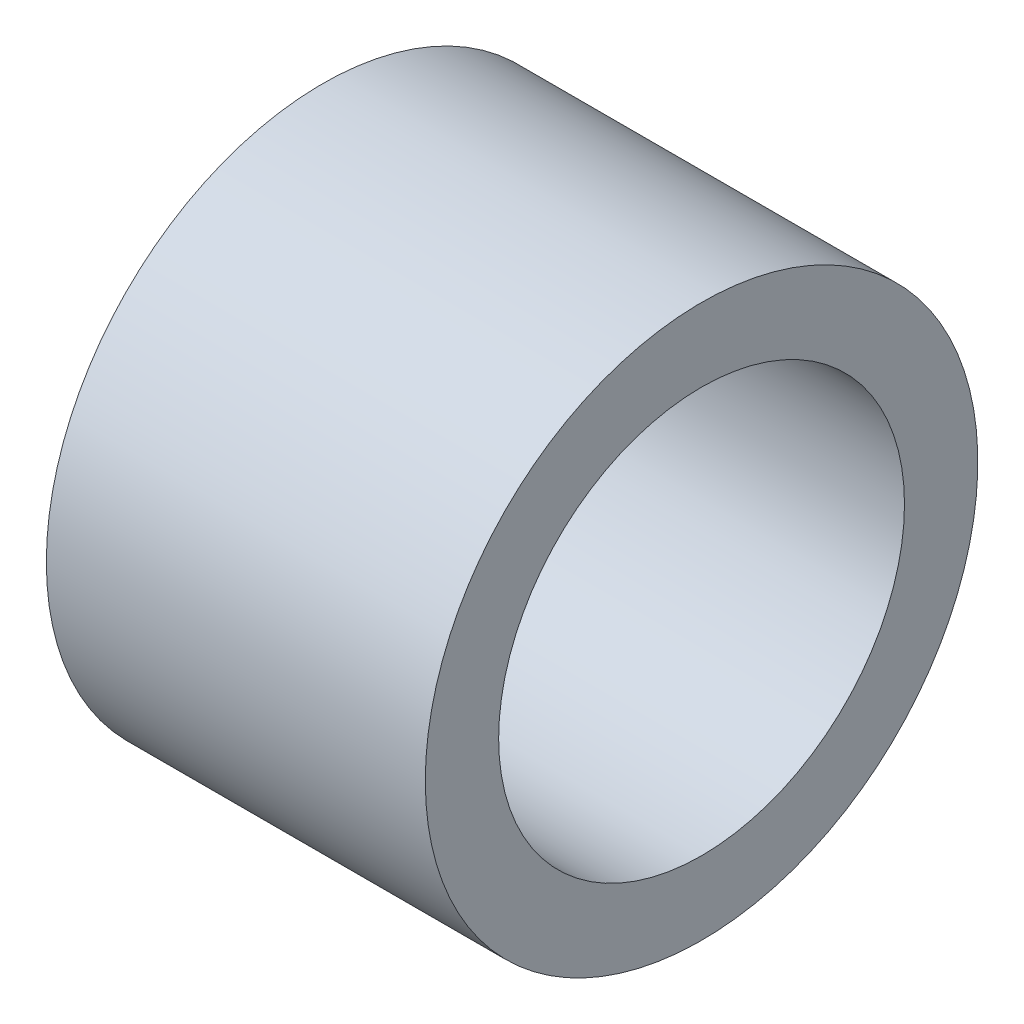
ISO-10303-21;
HEADER;
FILE_DESCRIPTION(('STEP AP214'),'2;1');
FILE_NAME('part.step','',(''),(''),'','','');
FILE_SCHEMA(('AUTOMOTIVE_DESIGN { 1 0 10303 214 1 1 1 1 }'));
ENDSEC;
DATA;
#1=APPLICATION_CONTEXT('core data for automotive mechanical design processes');
#2=APPLICATION_PROTOCOL_DEFINITION('international standard','automotive_design',2000,#1);
#3=PRODUCT_CONTEXT('',#1,'mechanical');
#4=PRODUCT('Part','Part','',(#3));
#5=PRODUCT_RELATED_PRODUCT_CATEGORY('part','',(#4));
#6=PRODUCT_DEFINITION_FORMATION('','',#4);
#7=PRODUCT_DEFINITION_CONTEXT('part definition',#1,'design');
#8=PRODUCT_DEFINITION('design','',#6,#7);
#9=PRODUCT_DEFINITION_SHAPE('','',#8);
#10=(LENGTH_UNIT() NAMED_UNIT(*) SI_UNIT(.MILLI.,.METRE.));
#11=(NAMED_UNIT(*) PLANE_ANGLE_UNIT() SI_UNIT($,.RADIAN.));
#12=(NAMED_UNIT(*) SI_UNIT($,.STERADIAN.) SOLID_ANGLE_UNIT());
#13=UNCERTAINTY_MEASURE_WITH_UNIT(LENGTH_MEASURE(1.E-05),#10,'distance_accuracy_value','');
#14=(GEOMETRIC_REPRESENTATION_CONTEXT(3) GLOBAL_UNCERTAINTY_ASSIGNED_CONTEXT((#13)) GLOBAL_UNIT_ASSIGNED_CONTEXT((#10,
#11,#12)) REPRESENTATION_CONTEXT('',''));
#15=CARTESIAN_POINT('',(0.,0.,0.));
#16=DIRECTION('',(0.,0.,1.));
#17=DIRECTION('',(1.,0.,0.));
#18=AXIS2_PLACEMENT_3D('',#15,#16,#17);
#19=CARTESIAN_POINT('',(7.75,0.,0.));
#20=DIRECTION('',(-1.,0.,0.));
#21=DIRECTION('',(0.,0.,1.));
#22=AXIS2_PLACEMENT_3D('',#19,#20,#21);
#23=PLANE('',#22);
#24=CARTESIAN_POINT('',(7.75,0.,0.));
#25=DIRECTION('',(-1.,0.,0.));
#26=DIRECTION('',(0.,0.,1.));
#27=AXIS2_PLACEMENT_3D('',#24,#25,#26);
#28=CIRCLE('',#27,5.65);
#29=CARTESIAN_POINT('',(7.75,0.,5.65));
#30=VERTEX_POINT('',#29);
#31=EDGE_CURVE('E56',#30,#30,#28,.T.);
#32=ORIENTED_EDGE('',*,*,#31,.F.);
#33=EDGE_LOOP('',(#32));
#34=FACE_BOUND('',#33,.T.);
#35=CARTESIAN_POINT('',(7.75,0.,0.));
#36=DIRECTION('',(-1.,0.,0.));
#37=DIRECTION('',(0.,0.,1.));
#38=AXIS2_PLACEMENT_3D('',#35,#36,#37);
#39=CIRCLE('',#38,4.15);
#40=CARTESIAN_POINT('',(7.75,0.,4.15));
#41=VERTEX_POINT('',#40);
#42=EDGE_CURVE('E10',#41,#41,#39,.T.);
#43=ORIENTED_EDGE('',*,*,#42,.T.);
#44=EDGE_LOOP('',(#43));
#45=FACE_BOUND('',#44,.T.);
#46=ADVANCED_FACE('F39',(#34,#45),#23,.F.);
#47=CARTESIAN_POINT('',(0.,0.,0.));
#48=DIRECTION('',(-1.,0.,0.));
#49=DIRECTION('',(0.,0.,1.));
#50=AXIS2_PLACEMENT_3D('',#47,#48,#49);
#51=CYLINDRICAL_SURFACE('',#50,4.15);
#52=ORIENTED_EDGE('',*,*,#42,.F.);
#53=EDGE_LOOP('',(#52));
#54=FACE_BOUND('',#53,.T.);
#55=CARTESIAN_POINT('',(0.,0.,0.));
#56=DIRECTION('',(-1.,0.,0.));
#57=DIRECTION('',(0.,0.,1.));
#58=AXIS2_PLACEMENT_3D('',#55,#56,#57);
#59=CIRCLE('',#58,4.15);
#60=CARTESIAN_POINT('',(0.,0.,4.15));
#61=VERTEX_POINT('',#60);
#62=EDGE_CURVE('E46',#61,#61,#59,.T.);
#63=ORIENTED_EDGE('',*,*,#62,.T.);
#64=EDGE_LOOP('',(#63));
#65=FACE_BOUND('',#64,.T.);
#66=ADVANCED_FACE('F67',(#54,#65),#51,.F.);
#67=CARTESIAN_POINT('',(0.,0.,0.));
#68=DIRECTION('',(-1.,0.,0.));
#69=DIRECTION('',(0.,0.,1.));
#70=AXIS2_PLACEMENT_3D('',#67,#68,#69);
#71=PLANE('',#70);
#72=CARTESIAN_POINT('',(0.,0.,0.));
#73=DIRECTION('',(-1.,0.,0.));
#74=DIRECTION('',(0.,0.,1.));
#75=AXIS2_PLACEMENT_3D('',#72,#73,#74);
#76=CIRCLE('',#75,5.65);
#77=CARTESIAN_POINT('',(0.,0.,5.65));
#78=VERTEX_POINT('',#77);
#79=EDGE_CURVE('E51',#78,#78,#76,.T.);
#80=ORIENTED_EDGE('',*,*,#79,.T.);
#81=EDGE_LOOP('',(#80));
#82=FACE_BOUND('',#81,.T.);
#83=ORIENTED_EDGE('',*,*,#62,.F.);
#84=EDGE_LOOP('',(#83));
#85=FACE_BOUND('',#84,.T.);
#86=ADVANCED_FACE('F71',(#82,#85),#71,.T.);
#87=CARTESIAN_POINT('',(0.,0.,0.));
#88=DIRECTION('',(-1.,0.,0.));
#89=DIRECTION('',(0.,0.,1.));
#90=AXIS2_PLACEMENT_3D('',#87,#88,#89);
#91=CYLINDRICAL_SURFACE('',#90,5.65);
#92=ORIENTED_EDGE('',*,*,#31,.T.);
#93=EDGE_LOOP('',(#92));
#94=FACE_BOUND('',#93,.T.);
#95=ORIENTED_EDGE('',*,*,#79,.F.);
#96=EDGE_LOOP('',(#95));
#97=FACE_BOUND('',#96,.T.);
#98=ADVANCED_FACE('F63',(#94,#97),#91,.T.);
#99=CLOSED_SHELL('',(#46,#66,#86,#98));
#100=MANIFOLD_SOLID_BREP('B2',#99);
#101=ADVANCED_BREP_SHAPE_REPRESENTATION('',(#18,#100),#14);
#102=SHAPE_DEFINITION_REPRESENTATION(#9,#101);
ENDSEC;
END-ISO-10303-21;
